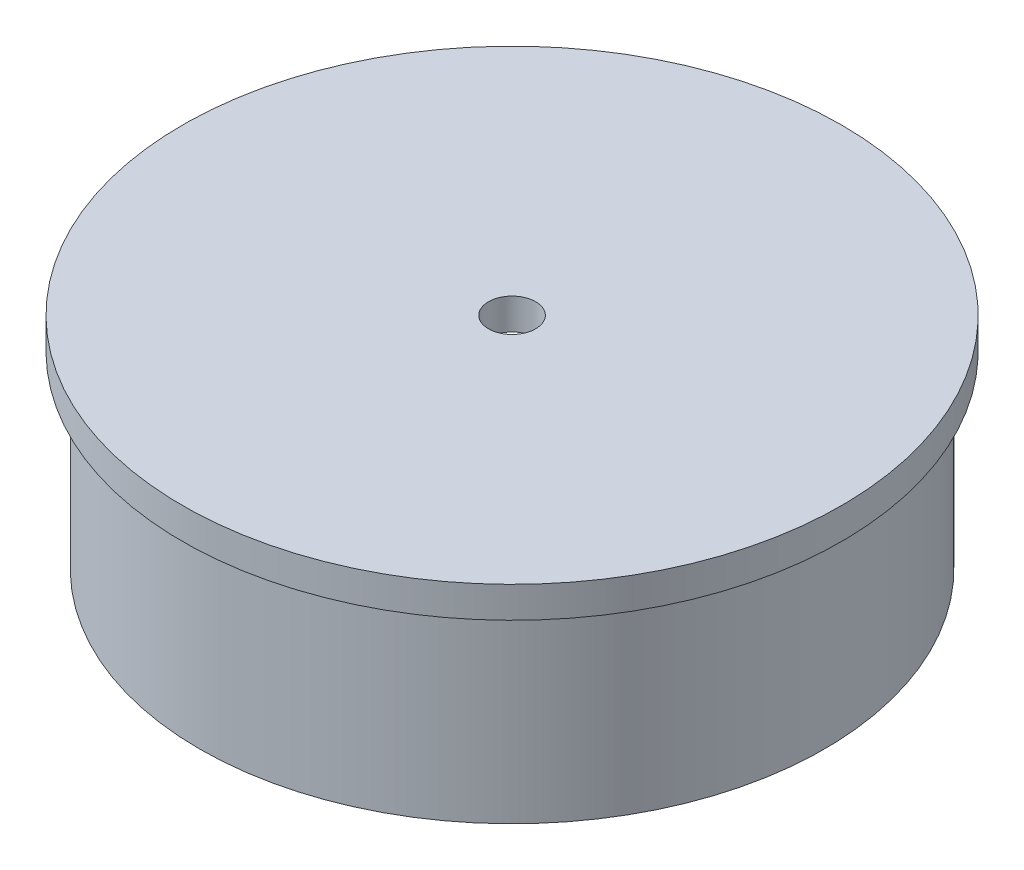
ISO-10303-21;
HEADER;
FILE_DESCRIPTION(('STEP AP214'),'2;1');
FILE_NAME('part.step','',(''),(''),'','','');
FILE_SCHEMA(('AUTOMOTIVE_DESIGN { 1 0 10303 214 1 1 1 1 }'));
ENDSEC;
DATA;
#1=APPLICATION_CONTEXT('core data for automotive mechanical design processes');
#2=APPLICATION_PROTOCOL_DEFINITION('international standard','automotive_design',2000,#1);
#3=PRODUCT_CONTEXT('',#1,'mechanical');
#4=PRODUCT('Part','Part','',(#3));
#5=PRODUCT_RELATED_PRODUCT_CATEGORY('part','',(#4));
#6=PRODUCT_DEFINITION_FORMATION('','',#4);
#7=PRODUCT_DEFINITION_CONTEXT('part definition',#1,'design');
#8=PRODUCT_DEFINITION('design','',#6,#7);
#9=PRODUCT_DEFINITION_SHAPE('','',#8);
#10=(LENGTH_UNIT() NAMED_UNIT(*) SI_UNIT(.MILLI.,.METRE.));
#11=(NAMED_UNIT(*) PLANE_ANGLE_UNIT() SI_UNIT($,.RADIAN.));
#12=(NAMED_UNIT(*) SI_UNIT($,.STERADIAN.) SOLID_ANGLE_UNIT());
#13=UNCERTAINTY_MEASURE_WITH_UNIT(LENGTH_MEASURE(1.E-05),#10,'distance_accuracy_value','');
#14=(GEOMETRIC_REPRESENTATION_CONTEXT(3) GLOBAL_UNCERTAINTY_ASSIGNED_CONTEXT((#13)) GLOBAL_UNIT_ASSIGNED_CONTEXT((#10,
#11,#12)) REPRESENTATION_CONTEXT('',''));
#15=CARTESIAN_POINT('',(0.,0.,0.));
#16=DIRECTION('',(0.,0.,1.));
#17=DIRECTION('',(1.,0.,0.));
#18=AXIS2_PLACEMENT_3D('',#15,#16,#17);
#19=CARTESIAN_POINT('',(1.5875,-2.1,0.));
#20=DIRECTION('',(0.,1.,0.));
#21=DIRECTION('',(0.,0.,1.));
#22=AXIS2_PLACEMENT_3D('',#19,#20,#21);
#23=PLANE('',#22);
#24=CARTESIAN_POINT('',(0.,-2.09999999999999,0.));
#25=DIRECTION('',(0.,-1.,0.));
#26=DIRECTION('',(0.,0.,-1.));
#27=AXIS2_PLACEMENT_3D('',#24,#25,#26);
#28=CIRCLE('',#27,1.5875);
#29=CARTESIAN_POINT('',(0.,-2.09999999999999,-1.5875));
#30=VERTEX_POINT('',#29);
#31=EDGE_CURVE('E61',#30,#30,#28,.T.);
#32=ORIENTED_EDGE('',*,*,#31,.F.);
#33=EDGE_LOOP('',(#32));
#34=FACE_BOUND('',#33,.T.);
#35=CARTESIAN_POINT('',(0.,-2.1,0.));
#36=DIRECTION('',(0.,-1.,0.));
#37=DIRECTION('',(0.,0.,-1.));
#38=AXIS2_PLACEMENT_3D('',#35,#36,#37);
#39=CIRCLE('',#38,17.4879);
#40=CARTESIAN_POINT('',(0.,-2.1,-17.4879));
#41=VERTEX_POINT('',#40);
#42=EDGE_CURVE('E58',#41,#41,#39,.T.);
#43=ORIENTED_EDGE('',*,*,#42,.T.);
#44=EDGE_LOOP('',(#43));
#45=FACE_BOUND('',#44,.T.);
#46=CARTESIAN_POINT('',(-4.70268180689715,-2.1,-9.525));
#47=DIRECTION('',(0.,1.,0.));
#48=DIRECTION('',(0.,0.,1.));
#49=AXIS2_PLACEMENT_3D('',#46,#47,#48);
#50=CIRCLE('',#49,3.65125);
#51=CARTESIAN_POINT('',(-4.70268180689715,-2.1,-5.87375));
#52=VERTEX_POINT('',#51);
#53=EDGE_CURVE('E44',#52,#52,#50,.T.);
#54=ORIENTED_EDGE('',*,*,#53,.T.);
#55=EDGE_LOOP('',(#54));
#56=FACE_BOUND('',#55,.T.);
#57=CARTESIAN_POINT('',(4.70268180689715,-2.1,-9.525));
#58=DIRECTION('',(0.,1.,0.));
#59=DIRECTION('',(0.,0.,1.));
#60=AXIS2_PLACEMENT_3D('',#57,#58,#59);
#61=CIRCLE('',#60,3.65125);
#62=CARTESIAN_POINT('',(4.70268180689715,-2.1,-5.87375));
#63=VERTEX_POINT('',#62);
#64=EDGE_CURVE('E40',#63,#63,#61,.T.);
#65=ORIENTED_EDGE('',*,*,#64,.T.);
#66=EDGE_LOOP('',(#65));
#67=FACE_BOUND('',#66,.T.);
#68=CARTESIAN_POINT('',(4.70268180689715,-2.1,9.525));
#69=DIRECTION('',(0.,1.,0.));
#70=DIRECTION('',(0.,0.,1.));
#71=AXIS2_PLACEMENT_3D('',#68,#69,#70);
#72=CIRCLE('',#71,2.38125);
#73=CARTESIAN_POINT('',(4.70268180689715,-2.1,11.90625));
#74=VERTEX_POINT('',#73);
#75=EDGE_CURVE('E89',#74,#74,#72,.T.);
#76=ORIENTED_EDGE('',*,*,#75,.T.);
#77=EDGE_LOOP('',(#76));
#78=FACE_BOUND('',#77,.T.);
#79=CARTESIAN_POINT('',(-4.70268180689715,-2.1,9.525));
#80=DIRECTION('',(0.,1.,0.));
#81=DIRECTION('',(0.,0.,1.));
#82=AXIS2_PLACEMENT_3D('',#79,#80,#81);
#83=CIRCLE('',#82,2.38125);
#84=CARTESIAN_POINT('',(-4.70268180689715,-2.1,11.90625));
#85=VERTEX_POINT('',#84);
#86=EDGE_CURVE('E10',#85,#85,#83,.F.);
#87=ORIENTED_EDGE('',*,*,#86,.F.);
#88=EDGE_LOOP('',(#87));
#89=FACE_BOUND('',#88,.T.);
#90=ADVANCED_FACE('F29',(#34,#45,#56,#67,#78,#89),#23,.F.);
#91=CARTESIAN_POINT('',(20.0279,-14.8,1.39854078212433E-13));
#92=DIRECTION('',(0.,1.,0.));
#93=DIRECTION('',(0.,0.,1.));
#94=AXIS2_PLACEMENT_3D('',#91,#92,#93);
#95=PLANE('',#94);
#96=CARTESIAN_POINT('',(0.,-14.8,0.));
#97=DIRECTION('',(0.,-1.,0.));
#98=DIRECTION('',(0.,0.,-1.));
#99=AXIS2_PLACEMENT_3D('',#96,#97,#98);
#100=CIRCLE('',#99,20.0279);
#101=CARTESIAN_POINT('',(0.,-14.8,-20.0279));
#102=VERTEX_POINT('',#101);
#103=EDGE_CURVE('E52',#102,#102,#100,.T.);
#104=ORIENTED_EDGE('',*,*,#103,.F.);
#105=EDGE_LOOP('',(#104));
#106=FACE_BOUND('',#105,.T.);
#107=CARTESIAN_POINT('',(0.,-14.8,0.));
#108=DIRECTION('',(0.,-1.,0.));
#109=DIRECTION('',(0.,0.,-1.));
#110=AXIS2_PLACEMENT_3D('',#107,#108,#109);
#111=CIRCLE('',#110,21.0693);
#112=CARTESIAN_POINT('',(0.,-14.8,-21.0693));
#113=VERTEX_POINT('',#112);
#114=EDGE_CURVE('E76',#113,#113,#111,.T.);
#115=ORIENTED_EDGE('',*,*,#114,.T.);
#116=EDGE_LOOP('',(#115));
#117=FACE_BOUND('',#116,.T.);
#118=ADVANCED_FACE('F114',(#106,#117),#95,.F.);
#119=CARTESIAN_POINT('',(0.,0.,0.));
#120=DIRECTION('',(0.,-1.,0.));
#121=DIRECTION('',(0.,0.,-1.));
#122=AXIS2_PLACEMENT_3D('',#119,#120,#121);
#123=CYLINDRICAL_SURFACE('',#122,20.0279);
#124=CARTESIAN_POINT('',(0.,-4.64,0.));
#125=DIRECTION('',(0.,-1.,0.));
#126=DIRECTION('',(0.,0.,-1.));
#127=AXIS2_PLACEMENT_3D('',#124,#125,#126);
#128=CIRCLE('',#127,20.0279);
#129=CARTESIAN_POINT('',(0.,-4.64,-20.0279));
#130=VERTEX_POINT('',#129);
#131=EDGE_CURVE('E55',#130,#130,#128,.T.);
#132=ORIENTED_EDGE('',*,*,#131,.F.);
#133=EDGE_LOOP('',(#132));
#134=FACE_BOUND('',#133,.T.);
#135=ORIENTED_EDGE('',*,*,#103,.T.);
#136=EDGE_LOOP('',(#135));
#137=FACE_BOUND('',#136,.T.);
#138=ADVANCED_FACE('F120',(#134,#137),#123,.F.);
#139=CARTESIAN_POINT('',(0.,-4.64,0.));
#140=DIRECTION('',(0.,-1.,0.));
#141=DIRECTION('',(0.,0.,-1.));
#142=AXIS2_PLACEMENT_3D('',#139,#140,#141);
#143=TOROIDAL_SURFACE('',#142,17.4879,2.54);
#144=ORIENTED_EDGE('',*,*,#42,.F.);
#145=EDGE_LOOP('',(#144));
#146=FACE_BOUND('',#145,.T.);
#147=ORIENTED_EDGE('',*,*,#131,.T.);
#148=EDGE_LOOP('',(#147));
#149=FACE_BOUND('',#148,.T.);
#150=ADVANCED_FACE('F129',(#146,#149),#143,.F.);
#151=CARTESIAN_POINT('',(0.,0.,0.));
#152=DIRECTION('',(0.,-1.,0.));
#153=DIRECTION('',(0.,0.,-1.));
#154=AXIS2_PLACEMENT_3D('',#151,#152,#153);
#155=CYLINDRICAL_SURFACE('',#154,1.5875);
#156=CARTESIAN_POINT('',(0.,0.,0.));
#157=DIRECTION('',(0.,-1.,0.));
#158=DIRECTION('',(0.,0.,-1.));
#159=AXIS2_PLACEMENT_3D('',#156,#157,#158);
#160=CIRCLE('',#159,1.5875);
#161=CARTESIAN_POINT('',(0.,0.,-1.5875));
#162=VERTEX_POINT('',#161);
#163=EDGE_CURVE('E64',#162,#162,#160,.T.);
#164=ORIENTED_EDGE('',*,*,#163,.F.);
#165=EDGE_LOOP('',(#164));
#166=FACE_BOUND('',#165,.T.);
#167=ORIENTED_EDGE('',*,*,#31,.T.);
#168=EDGE_LOOP('',(#167));
#169=FACE_BOUND('',#168,.T.);
#170=ADVANCED_FACE('F127',(#166,#169),#155,.F.);
#171=CARTESIAN_POINT('',(22.225,0.,1.55196345511577E-13));
#172=DIRECTION('',(0.,-1.,0.));
#173=DIRECTION('',(0.,0.,-1.));
#174=AXIS2_PLACEMENT_3D('',#171,#172,#173);
#175=PLANE('',#174);
#176=CARTESIAN_POINT('',(0.,0.,0.));
#177=DIRECTION('',(0.,-1.,0.));
#178=DIRECTION('',(0.,0.,-1.));
#179=AXIS2_PLACEMENT_3D('',#176,#177,#178);
#180=CIRCLE('',#179,22.225);
#181=CARTESIAN_POINT('',(0.,0.,-22.225));
#182=VERTEX_POINT('',#181);
#183=EDGE_CURVE('E67',#182,#182,#180,.T.);
#184=ORIENTED_EDGE('',*,*,#183,.F.);
#185=EDGE_LOOP('',(#184));
#186=FACE_BOUND('',#185,.T.);
#187=ORIENTED_EDGE('',*,*,#163,.T.);
#188=EDGE_LOOP('',(#187));
#189=FACE_BOUND('',#188,.T.);
#190=ADVANCED_FACE('F170',(#186,#189),#175,.F.);
#191=CARTESIAN_POINT('',(0.,0.,0.));
#192=DIRECTION('',(0.,-1.,0.));
#193=DIRECTION('',(0.,0.,-1.));
#194=AXIS2_PLACEMENT_3D('',#191,#192,#193);
#195=CYLINDRICAL_SURFACE('',#194,22.225);
#196=CARTESIAN_POINT('',(0.,-2.1,0.));
#197=DIRECTION('',(0.,-1.,0.));
#198=DIRECTION('',(0.,0.,-1.));
#199=AXIS2_PLACEMENT_3D('',#196,#197,#198);
#200=CIRCLE('',#199,22.225);
#201=CARTESIAN_POINT('',(0.,-2.1,-22.225));
#202=VERTEX_POINT('',#201);
#203=EDGE_CURVE('E70',#202,#202,#200,.T.);
#204=ORIENTED_EDGE('',*,*,#203,.F.);
#205=EDGE_LOOP('',(#204));
#206=FACE_BOUND('',#205,.T.);
#207=ORIENTED_EDGE('',*,*,#183,.T.);
#208=EDGE_LOOP('',(#207));
#209=FACE_BOUND('',#208,.T.);
#210=ADVANCED_FACE('F167',(#206,#209),#195,.T.);
#211=CARTESIAN_POINT('',(21.0693,-2.1,1.47126135544975E-13));
#212=DIRECTION('',(0.,1.,0.));
#213=DIRECTION('',(0.,0.,1.));
#214=AXIS2_PLACEMENT_3D('',#211,#212,#213);
#215=PLANE('',#214);
#216=CARTESIAN_POINT('',(0.,-2.1,0.));
#217=DIRECTION('',(0.,-1.,0.));
#218=DIRECTION('',(0.,0.,-1.));
#219=AXIS2_PLACEMENT_3D('',#216,#217,#218);
#220=CIRCLE('',#219,21.0693);
#221=CARTESIAN_POINT('',(0.,-2.1,-21.0693));
#222=VERTEX_POINT('',#221);
#223=EDGE_CURVE('E73',#222,#222,#220,.T.);
#224=ORIENTED_EDGE('',*,*,#223,.F.);
#225=EDGE_LOOP('',(#224));
#226=FACE_BOUND('',#225,.T.);
#227=ORIENTED_EDGE('',*,*,#203,.T.);
#228=EDGE_LOOP('',(#227));
#229=FACE_BOUND('',#228,.T.);
#230=ADVANCED_FACE('F161',(#226,#229),#215,.F.);
#231=CARTESIAN_POINT('',(0.,0.,0.));
#232=DIRECTION('',(0.,-1.,0.));
#233=DIRECTION('',(0.,0.,-1.));
#234=AXIS2_PLACEMENT_3D('',#231,#232,#233);
#235=CYLINDRICAL_SURFACE('',#234,21.0693);
#236=ORIENTED_EDGE('',*,*,#114,.F.);
#237=EDGE_LOOP('',(#236));
#238=FACE_BOUND('',#237,.T.);
#239=ORIENTED_EDGE('',*,*,#223,.T.);
#240=EDGE_LOOP('',(#239));
#241=FACE_BOUND('',#240,.T.);
#242=ADVANCED_FACE('F156',(#238,#241),#235,.T.);
#243=CARTESIAN_POINT('',(-4.70268180689715,-4.55516676711909,-9.525));
#244=DIRECTION('',(0.,1.,0.));
#245=DIRECTION('',(-1.,0.,0.));
#246=AXIS2_PLACEMENT_3D('',#243,#244,#245);
#247=CYLINDRICAL_SURFACE('',#246,2.38125);
#248=CARTESIAN_POINT('',(-4.70268180689715,-3.37,-9.525));
#249=DIRECTION('',(0.,1.,0.));
#250=DIRECTION('',(0.,0.,1.));
#251=AXIS2_PLACEMENT_3D('',#248,#249,#250);
#252=CIRCLE('',#251,2.38125);
#253=CARTESIAN_POINT('',(-4.70268180689715,-3.37,-7.14375));
#254=VERTEX_POINT('',#253);
#255=EDGE_CURVE('E36',#254,#254,#252,.F.);
#256=ORIENTED_EDGE('',*,*,#255,.T.);
#257=EDGE_LOOP('',(#256));
#258=FACE_BOUND('',#257,.T.);
#259=CARTESIAN_POINT('',(-4.70268180689715,-4.55516676711909,-9.525));
#260=DIRECTION('',(0.,1.,0.));
#261=DIRECTION('',(0.,0.,-1.));
#262=AXIS2_PLACEMENT_3D('',#259,#260,#261);
#263=CIRCLE('',#262,2.38125);
#264=CARTESIAN_POINT('',(-7.08393180689715,-4.55516676711909,-9.525));
#265=VERTEX_POINT('',#264);
#266=EDGE_CURVE('E79',#265,#265,#263,.T.);
#267=ORIENTED_EDGE('',*,*,#266,.T.);
#268=EDGE_LOOP('',(#267));
#269=FACE_BOUND('',#268,.T.);
#270=ADVANCED_FACE('F151',(#258,#269),#247,.T.);
#271=CARTESIAN_POINT('',(0.,-4.55516676711909,-9.525));
#272=DIRECTION('',(0.,0.,-1.));
#273=DIRECTION('',(-1.,0.,0.));
#274=AXIS2_PLACEMENT_3D('',#271,#272,#273);
#275=TOROIDAL_SURFACE('',#274,4.70268180689715,2.38125);
#276=CARTESIAN_POINT('',(4.70268180689715,-4.55516676711909,-9.525));
#277=DIRECTION('',(0.,-1.,0.));
#278=DIRECTION('',(0.,0.,-1.));
#279=AXIS2_PLACEMENT_3D('',#276,#277,#278);
#280=CIRCLE('',#279,2.38125);
#281=CARTESIAN_POINT('',(7.08393180689715,-4.55516676711909,-9.525));
#282=VERTEX_POINT('',#281);
#283=EDGE_CURVE('E82',#282,#282,#280,.T.);
#284=CARTESIAN_POINT('',(0.,-4.55516676711909,-9.525));
#285=DIRECTION('',(0.,0.,-1.));
#286=DIRECTION('',(-1.,0.,0.));
#287=AXIS2_PLACEMENT_3D('',#284,#285,#286);
#288=CIRCLE('',#287,7.08393180689715);
#289=EDGE_CURVE('',#282,#265,#288,.T.);
#290=ORIENTED_EDGE('',*,*,#283,.T.);
#291=ORIENTED_EDGE('',*,*,#266,.F.);
#292=ORIENTED_EDGE('',*,*,#289,.T.);
#293=ORIENTED_EDGE('',*,*,#289,.F.);
#294=EDGE_LOOP('',(#290,#292,#291,#293));
#295=FACE_BOUND('',#294,.T.);
#296=ADVANCED_FACE('F141',(#295),#275,.T.);
#297=CARTESIAN_POINT('',(4.70268180689715,-4.55516676711909,-9.525));
#298=DIRECTION('',(0.,1.,0.));
#299=DIRECTION('',(-1.,0.,0.));
#300=AXIS2_PLACEMENT_3D('',#297,#298,#299);
#301=CYLINDRICAL_SURFACE('',#300,2.38125);
#302=CARTESIAN_POINT('',(4.70268180689715,-3.37,-9.525));
#303=DIRECTION('',(0.,1.,0.));
#304=DIRECTION('',(0.,0.,1.));
#305=AXIS2_PLACEMENT_3D('',#302,#303,#304);
#306=CIRCLE('',#305,2.38125);
#307=CARTESIAN_POINT('',(4.70268180689715,-3.37,-7.14375));
#308=VERTEX_POINT('',#307);
#309=EDGE_CURVE('E49',#308,#308,#306,.F.);
#310=ORIENTED_EDGE('',*,*,#309,.T.);
#311=EDGE_LOOP('',(#310));
#312=FACE_BOUND('',#311,.T.);
#313=ORIENTED_EDGE('',*,*,#283,.F.);
#314=EDGE_LOOP('',(#313));
#315=FACE_BOUND('',#314,.T.);
#316=ADVANCED_FACE('F136',(#312,#315),#301,.T.);
#317=CARTESIAN_POINT('',(4.70268180689715,-3.37,-9.525));
#318=DIRECTION('',(0.,1.,0.));
#319=DIRECTION('',(0.,0.,1.));
#320=AXIS2_PLACEMENT_3D('',#317,#318,#319);
#321=TOROIDAL_SURFACE('',#320,3.65125,1.27);
#322=ORIENTED_EDGE('',*,*,#64,.F.);
#323=EDGE_LOOP('',(#322));
#324=FACE_BOUND('',#323,.T.);
#325=ORIENTED_EDGE('',*,*,#309,.F.);
#326=EDGE_LOOP('',(#325));
#327=FACE_BOUND('',#326,.T.);
#328=ADVANCED_FACE('F110',(#324,#327),#321,.F.);
#329=CARTESIAN_POINT('',(-4.70268180689715,-3.37,-9.525));
#330=DIRECTION('',(0.,1.,0.));
#331=DIRECTION('',(0.,0.,1.));
#332=AXIS2_PLACEMENT_3D('',#329,#330,#331);
#333=TOROIDAL_SURFACE('',#332,3.65125,1.27);
#334=ORIENTED_EDGE('',*,*,#255,.F.);
#335=EDGE_LOOP('',(#334));
#336=FACE_BOUND('',#335,.T.);
#337=ORIENTED_EDGE('',*,*,#53,.F.);
#338=EDGE_LOOP('',(#337));
#339=FACE_BOUND('',#338,.T.);
#340=ADVANCED_FACE('F31',(#336,#339),#333,.F.);
#341=CARTESIAN_POINT('',(-4.70268180689715,-4.55516676711902,9.525));
#342=DIRECTION('',(0.,1.,0.));
#343=DIRECTION('',(-1.,0.,0.));
#344=AXIS2_PLACEMENT_3D('',#341,#342,#343);
#345=CYLINDRICAL_SURFACE('',#344,2.38125);
#346=CARTESIAN_POINT('',(-4.70268180689715,-4.55516676711902,9.525));
#347=DIRECTION('',(0.,-1.,0.));
#348=DIRECTION('',(0.,0.,1.));
#349=AXIS2_PLACEMENT_3D('',#346,#347,#348);
#350=CIRCLE('',#349,2.38125);
#351=CARTESIAN_POINT('',(-7.08393180689715,-4.55516676711899,9.525));
#352=VERTEX_POINT('',#351);
#353=EDGE_CURVE('E85',#352,#352,#350,.T.);
#354=ORIENTED_EDGE('',*,*,#353,.F.);
#355=EDGE_LOOP('',(#354));
#356=FACE_BOUND('',#355,.T.);
#357=ORIENTED_EDGE('',*,*,#86,.T.);
#358=EDGE_LOOP('',(#357));
#359=FACE_BOUND('',#358,.T.);
#360=ADVANCED_FACE('F101',(#356,#359),#345,.T.);
#361=CARTESIAN_POINT('',(0.,-4.55516676711909,9.525));
#362=DIRECTION('',(0.,0.,-1.));
#363=DIRECTION('',(-1.,0.,0.));
#364=AXIS2_PLACEMENT_3D('',#361,#362,#363);
#365=TOROIDAL_SURFACE('',#364,4.70268180689715,2.38125);
#366=CARTESIAN_POINT('',(4.70268180689715,-4.55516676711909,9.525));
#367=DIRECTION('',(0.,1.,0.));
#368=DIRECTION('',(0.,0.,1.));
#369=AXIS2_PLACEMENT_3D('',#366,#367,#368);
#370=CIRCLE('',#369,2.38125);
#371=CARTESIAN_POINT('',(7.08393180689715,-4.55516676711909,9.525));
#372=VERTEX_POINT('',#371);
#373=EDGE_CURVE('E88',#372,#372,#370,.T.);
#374=CARTESIAN_POINT('',(0.,-4.55516676711909,9.525));
#375=DIRECTION('',(0.,0.,-1.));
#376=DIRECTION('',(-1.,0.,0.));
#377=AXIS2_PLACEMENT_3D('',#374,#375,#376);
#378=CIRCLE('',#377,7.08393180689715);
#379=EDGE_CURVE('',#372,#352,#378,.T.);
#380=ORIENTED_EDGE('',*,*,#373,.F.);
#381=ORIENTED_EDGE('',*,*,#353,.T.);
#382=ORIENTED_EDGE('',*,*,#379,.T.);
#383=ORIENTED_EDGE('',*,*,#379,.F.);
#384=EDGE_LOOP('',(#380,#382,#381,#383));
#385=FACE_BOUND('',#384,.T.);
#386=ADVANCED_FACE('F98',(#385),#365,.T.);
#387=CARTESIAN_POINT('',(4.70268180689715,-4.55516676711909,9.525));
#388=DIRECTION('',(0.,1.,0.));
#389=DIRECTION('',(-1.,0.,0.));
#390=AXIS2_PLACEMENT_3D('',#387,#388,#389);
#391=CYLINDRICAL_SURFACE('',#390,2.38125);
#392=ORIENTED_EDGE('',*,*,#373,.T.);
#393=EDGE_LOOP('',(#392));
#394=FACE_BOUND('',#393,.T.);
#395=ORIENTED_EDGE('',*,*,#75,.F.);
#396=EDGE_LOOP('',(#395));
#397=FACE_BOUND('',#396,.T.);
#398=ADVANCED_FACE('F95',(#394,#397),#391,.T.);
#399=CLOSED_SHELL('',(#90,#118,#138,#150,#170,#190,#210,#230,#242,#270,#296,#316,#328,#340,#360,
#386,#398));
#400=MANIFOLD_SOLID_BREP('B2',#399);
#401=ADVANCED_BREP_SHAPE_REPRESENTATION('',(#18,#400),#14);
#402=SHAPE_DEFINITION_REPRESENTATION(#9,#401);
ENDSEC;
END-ISO-10303-21;
